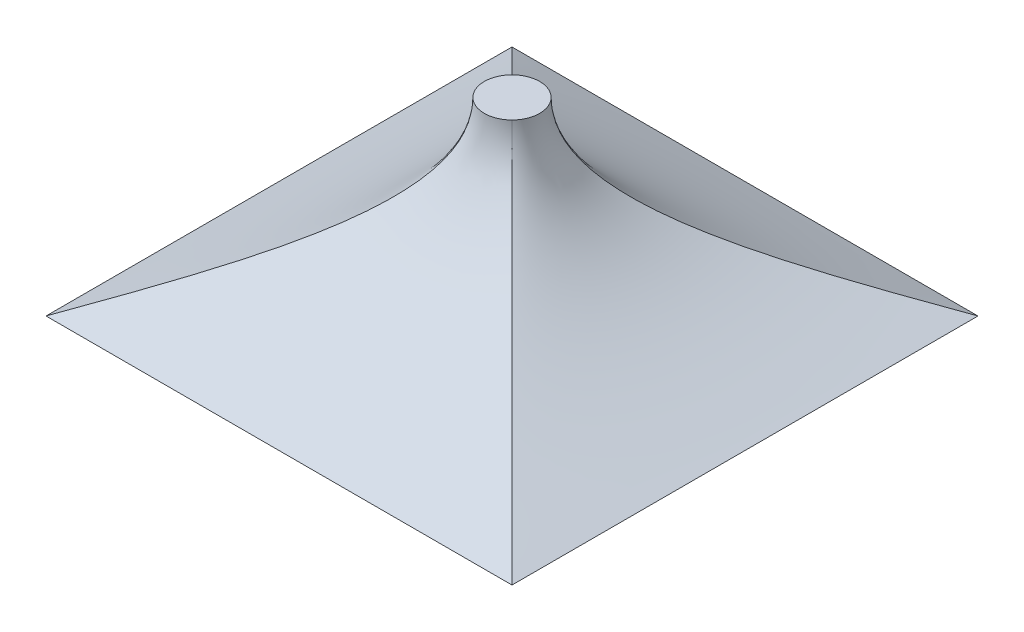
ISO-10303-21;
HEADER;
FILE_DESCRIPTION(('STEP AP214'),'2;1');
FILE_NAME('part.step','',(''),(''),'','','');
FILE_SCHEMA(('AUTOMOTIVE_DESIGN { 1 0 10303 214 1 1 1 1 }'));
ENDSEC;
DATA;
#1=APPLICATION_CONTEXT('core data for automotive mechanical design processes');
#2=APPLICATION_PROTOCOL_DEFINITION('international standard','automotive_design',2000,#1);
#3=PRODUCT_CONTEXT('',#1,'mechanical');
#4=PRODUCT('Part','Part','',(#3));
#5=PRODUCT_RELATED_PRODUCT_CATEGORY('part','',(#4));
#6=PRODUCT_DEFINITION_FORMATION('','',#4);
#7=PRODUCT_DEFINITION_CONTEXT('part definition',#1,'design');
#8=PRODUCT_DEFINITION('design','',#6,#7);
#9=PRODUCT_DEFINITION_SHAPE('','',#8);
#10=(LENGTH_UNIT() NAMED_UNIT(*) SI_UNIT(.MILLI.,.METRE.));
#11=(NAMED_UNIT(*) PLANE_ANGLE_UNIT() SI_UNIT($,.RADIAN.));
#12=(NAMED_UNIT(*) SI_UNIT($,.STERADIAN.) SOLID_ANGLE_UNIT());
#13=UNCERTAINTY_MEASURE_WITH_UNIT(LENGTH_MEASURE(1.E-05),#10,'distance_accuracy_value','');
#14=(GEOMETRIC_REPRESENTATION_CONTEXT(3) GLOBAL_UNCERTAINTY_ASSIGNED_CONTEXT((#13)) GLOBAL_UNIT_ASSIGNED_CONTEXT((#10,
#11,#12)) REPRESENTATION_CONTEXT('',''));
#15=CARTESIAN_POINT('',(0.,0.,0.));
#16=DIRECTION('',(0.,0.,1.));
#17=DIRECTION('',(1.,0.,0.));
#18=AXIS2_PLACEMENT_3D('',#15,#16,#17);
#19=CARTESIAN_POINT('',(0.,3.25,0.));
#20=DIRECTION('',(0.,1.,0.));
#21=DIRECTION('',(0.,0.,1.));
#22=AXIS2_PLACEMENT_3D('',#19,#20,#21);
#23=PLANE('',#22);
#24=CARTESIAN_POINT('',(0.,3.25,0.));
#25=DIRECTION('',(0.,1.,0.));
#26=DIRECTION('',(0.,0.,1.));
#27=AXIS2_PLACEMENT_3D('',#24,#25,#26);
#28=CIRCLE('',#27,0.475);
#29=CARTESIAN_POINT('',(0.33587572106361,3.25,0.335875721063609));
#30=VERTEX_POINT('',#29);
#31=CARTESIAN_POINT('',(0.33587572106361,3.25,-0.335875721063609));
#32=VERTEX_POINT('',#31);
#33=EDGE_CURVE('E121',#30,#32,#28,.T.);
#34=ORIENTED_EDGE('',*,*,#33,.T.);
#35=CARTESIAN_POINT('',(-0.33587572106361,3.25,-0.335875721063609));
#36=VERTEX_POINT('',#35);
#37=EDGE_CURVE('E116',#32,#36,#28,.T.);
#38=ORIENTED_EDGE('',*,*,#37,.T.);
#39=CARTESIAN_POINT('',(-0.33587572106361,3.25,0.335875721063609));
#40=VERTEX_POINT('',#39);
#41=EDGE_CURVE('E139',#36,#40,#28,.T.);
#42=ORIENTED_EDGE('',*,*,#41,.T.);
#43=EDGE_CURVE('E124',#40,#30,#28,.T.);
#44=ORIENTED_EDGE('',*,*,#43,.T.);
#45=EDGE_LOOP('',(#34,#38,#42,#44));
#46=FACE_BOUND('',#45,.T.);
#47=ADVANCED_FACE('F76',(#46),#23,.T.);
#48=CARTESIAN_POINT('',(0.,0.,0.));
#49=DIRECTION('',(0.,1.,0.));
#50=DIRECTION('',(0.,0.,1.));
#51=AXIS2_PLACEMENT_3D('',#48,#49,#50);
#52=PLANE('',#51);
#53=DIRECTION('',(0.,0.,-1.));
#54=VECTOR('',#53,1.);
#55=CARTESIAN_POINT('',(4.,0.,-4.));
#56=LINE('',#55,#54);
#57=CARTESIAN_POINT('',(4.00000000000001,0.,4.));
#58=VERTEX_POINT('',#57);
#59=CARTESIAN_POINT('',(4.,0.,-4.));
#60=VERTEX_POINT('',#59);
#61=EDGE_CURVE('E144',#58,#60,#56,.T.);
#62=ORIENTED_EDGE('',*,*,#61,.F.);
#63=DIRECTION('',(1.,0.,0.));
#64=VECTOR('',#63,1.);
#65=CARTESIAN_POINT('',(-4.,0.,4.));
#66=LINE('',#65,#64);
#67=CARTESIAN_POINT('',(-4.,0.,4.));
#68=VERTEX_POINT('',#67);
#69=EDGE_CURVE('E278',#68,#58,#66,.T.);
#70=ORIENTED_EDGE('',*,*,#69,.F.);
#71=DIRECTION('',(0.,0.,1.));
#72=VECTOR('',#71,1.);
#73=CARTESIAN_POINT('',(-4.,0.,-4.));
#74=LINE('',#73,#72);
#75=CARTESIAN_POINT('',(-4.,0.,-4.));
#76=VERTEX_POINT('',#75);
#77=EDGE_CURVE('E87',#76,#68,#74,.T.);
#78=ORIENTED_EDGE('',*,*,#77,.F.);
#79=DIRECTION('',(-1.,0.,0.));
#80=VECTOR('',#79,1.);
#81=CARTESIAN_POINT('',(-4.,0.,-4.));
#82=LINE('',#81,#80);
#83=EDGE_CURVE('E12',#60,#76,#82,.T.);
#84=ORIENTED_EDGE('',*,*,#83,.F.);
#85=EDGE_LOOP('',(#62,#70,#78,#84));
#86=FACE_BOUND('',#85,.T.);
#87=ADVANCED_FACE('F253',(#86),#52,.F.);
#88=CARTESIAN_POINT('',(-4.,0.,4.));
#89=CARTESIAN_POINT('',(-2.1679378605318,0.86041153366069,2.16793786053181));
#90=CARTESIAN_POINT('',(-0.33587572106361,1.72082306732138,0.335875721063609));
#91=CARTESIAN_POINT('',(-0.33587572106361,3.25,0.335875721063609));
#92=CARTESIAN_POINT('',(-1.33333333333333,0.,4.));
#93=CARTESIAN_POINT('',(-0.741917101236594,0.86041153366069,2.26062528649368));
#94=CARTESIAN_POINT('',(-0.150500869139859,1.72082306732138,0.521250572987362));
#95=CARTESIAN_POINT('',(-0.150500869139859,3.25,0.521250572987362));
#96=CARTESIAN_POINT('',(1.33333333333334,0.,4.));
#97=CARTESIAN_POINT('',(0.741917101236599,0.86041153366069,2.26062528649368));
#98=CARTESIAN_POINT('',(0.150500869139859,1.72082306732138,0.521250572987362));
#99=CARTESIAN_POINT('',(0.150500869139859,3.25,0.521250572987362));
#100=CARTESIAN_POINT('',(4.00000000000001,0.,4.));
#101=CARTESIAN_POINT('',(2.16793786053181,0.86041153366069,2.16793786053181));
#102=CARTESIAN_POINT('',(0.33587572106361,1.72082306732138,0.335875721063609));
#103=CARTESIAN_POINT('',(0.33587572106361,3.25,0.335875721063609));
#104=B_SPLINE_SURFACE_WITH_KNOTS('',3,3,((#88,#89,#90,#91),(#92,#93,#94,#95),(#96,#97,#98,#99),
(#100,#101,#102,#103)),.UNSPECIFIED.,.F.,.F.,.F.,(4,4),(4,4),(0.,1.),(0.,1.),.UNSPECIFIED.);
#105=CARTESIAN_POINT('',(4.00000000000001,0.,4.));
#106=CARTESIAN_POINT('',(2.16793786053181,0.86041153366069,2.16793786053181));
#107=CARTESIAN_POINT('',(0.33587572106361,1.72082306732138,0.335875721063609));
#108=CARTESIAN_POINT('',(0.33587572106361,3.25,0.335875721063609));
#109=B_SPLINE_CURVE_WITH_KNOTS('',3,(#105,#106,#107,#108),.UNSPECIFIED.,.F.,.F.,(4,4),(0.,1.),.UNSPECIFIED.);
#110=EDGE_CURVE('E149',#58,#30,#109,.T.);
#111=CARTESIAN_POINT('',(-4.,0.,4.));
#112=CARTESIAN_POINT('',(-2.1679378605318,0.86041153366069,2.16793786053181));
#113=CARTESIAN_POINT('',(-0.33587572106361,1.72082306732138,0.335875721063609));
#114=CARTESIAN_POINT('',(-0.33587572106361,3.25,0.335875721063609));
#115=B_SPLINE_CURVE_WITH_KNOTS('',3,(#111,#112,#113,#114),.UNSPECIFIED.,.F.,.F.,(4,4),(0.,1.),.UNSPECIFIED.);
#116=EDGE_CURVE('E146',#40,#68,#115,.F.);
#117=ORIENTED_EDGE('',*,*,#69,.T.);
#118=ORIENTED_EDGE('',*,*,#110,.T.);
#119=ORIENTED_EDGE('',*,*,#43,.F.);
#120=ORIENTED_EDGE('',*,*,#116,.T.);
#121=EDGE_LOOP('',(#117,#118,#119,#120));
#122=FACE_BOUND('',#121,.T.);
#123=ADVANCED_FACE('F236',(#122),#104,.T.);
#124=CARTESIAN_POINT('',(4.00000000000001,0.,4.));
#125=CARTESIAN_POINT('',(2.16793786053181,0.86041153366069,2.16793786053181));
#126=CARTESIAN_POINT('',(0.33587572106361,1.72082306732138,0.335875721063609));
#127=CARTESIAN_POINT('',(0.33587572106361,3.25,0.335875721063609));
#128=CARTESIAN_POINT('',(4.00000000000001,0.,1.33333333333333));
#129=CARTESIAN_POINT('',(2.26062528649368,0.86041153366069,0.741917101236595));
#130=CARTESIAN_POINT('',(0.521250572987361,1.72082306732138,0.150500869139859));
#131=CARTESIAN_POINT('',(0.521250572987361,3.25,0.150500869139859));
#132=CARTESIAN_POINT('',(4.,0.,-1.33333333333333));
#133=CARTESIAN_POINT('',(2.26062528649368,0.86041153366069,-0.741917101236595));
#134=CARTESIAN_POINT('',(0.521250572987361,1.72082306732138,-0.150500869139859));
#135=CARTESIAN_POINT('',(0.521250572987361,3.25,-0.150500869139859));
#136=CARTESIAN_POINT('',(4.,0.,-4.));
#137=CARTESIAN_POINT('',(2.16793786053181,0.86041153366069,-2.16793786053181));
#138=CARTESIAN_POINT('',(0.33587572106361,1.72082306732138,-0.335875721063609));
#139=CARTESIAN_POINT('',(0.33587572106361,3.25,-0.335875721063609));
#140=B_SPLINE_SURFACE_WITH_KNOTS('',3,3,((#124,#125,#126,#127),(#128,#129,#130,#131),(#132,#133,
#134,#135),(#136,#137,#138,#139)),.UNSPECIFIED.,.F.,.F.,.F.,(4,4),(4,4),(0.,1.),(0.,1.),.UNSPECIFIED.);
#141=CARTESIAN_POINT('',(4.,0.,-4.));
#142=CARTESIAN_POINT('',(2.16793786053181,0.86041153366069,-2.16793786053181));
#143=CARTESIAN_POINT('',(0.33587572106361,1.72082306732138,-0.335875721063609));
#144=CARTESIAN_POINT('',(0.33587572106361,3.25,-0.335875721063609));
#145=B_SPLINE_CURVE_WITH_KNOTS('',3,(#141,#142,#143,#144),.UNSPECIFIED.,.F.,.F.,(4,4),(0.,1.),.UNSPECIFIED.);
#146=EDGE_CURVE('E138',#60,#32,#145,.T.);
#147=ORIENTED_EDGE('',*,*,#61,.T.);
#148=ORIENTED_EDGE('',*,*,#146,.T.);
#149=ORIENTED_EDGE('',*,*,#33,.F.);
#150=ORIENTED_EDGE('',*,*,#110,.F.);
#151=EDGE_LOOP('',(#147,#148,#149,#150));
#152=FACE_BOUND('',#151,.T.);
#153=ADVANCED_FACE('F143',(#152),#140,.T.);
#154=CARTESIAN_POINT('',(-4.,0.,-4.));
#155=CARTESIAN_POINT('',(-2.1679378605318,0.86041153366069,-2.16793786053181));
#156=CARTESIAN_POINT('',(-0.33587572106361,1.72082306732138,-0.335875721063609));
#157=CARTESIAN_POINT('',(-0.33587572106361,3.25,-0.335875721063609));
#158=CARTESIAN_POINT('',(-4.,0.,-1.33333333333333));
#159=CARTESIAN_POINT('',(-2.26062528649368,0.86041153366069,-0.741917101236597));
#160=CARTESIAN_POINT('',(-0.521250572987361,1.72082306732138,-0.150500869139859));
#161=CARTESIAN_POINT('',(-0.521250572987361,3.25,-0.150500869139859));
#162=CARTESIAN_POINT('',(-4.,0.,1.33333333333333));
#163=CARTESIAN_POINT('',(-2.26062528649368,0.86041153366069,0.741917101236595));
#164=CARTESIAN_POINT('',(-0.521250572987361,1.72082306732138,0.150500869139859));
#165=CARTESIAN_POINT('',(-0.521250572987361,3.25,0.150500869139859));
#166=CARTESIAN_POINT('',(-4.,0.,4.));
#167=CARTESIAN_POINT('',(-2.1679378605318,0.86041153366069,2.16793786053181));
#168=CARTESIAN_POINT('',(-0.33587572106361,1.72082306732138,0.335875721063609));
#169=CARTESIAN_POINT('',(-0.33587572106361,3.25,0.335875721063609));
#170=B_SPLINE_SURFACE_WITH_KNOTS('',3,3,((#154,#155,#156,#157),(#158,#159,#160,#161),(#162,#163,
#164,#165),(#166,#167,#168,#169)),.UNSPECIFIED.,.F.,.F.,.F.,(4,4),(4,4),(0.,1.),(0.,1.),.UNSPECIFIED.);
#171=CARTESIAN_POINT('',(-4.,0.,-4.));
#172=CARTESIAN_POINT('',(-2.1679378605318,0.86041153366069,-2.16793786053181));
#173=CARTESIAN_POINT('',(-0.33587572106361,1.72082306732138,-0.335875721063609));
#174=CARTESIAN_POINT('',(-0.33587572106361,3.25,-0.335875721063609));
#175=B_SPLINE_CURVE_WITH_KNOTS('',3,(#171,#172,#173,#174),.UNSPECIFIED.,.F.,.F.,(4,4),(0.,1.),.UNSPECIFIED.);
#176=EDGE_CURVE('E129',#76,#36,#175,.T.);
#177=ORIENTED_EDGE('',*,*,#77,.T.);
#178=ORIENTED_EDGE('',*,*,#116,.F.);
#179=ORIENTED_EDGE('',*,*,#41,.F.);
#180=ORIENTED_EDGE('',*,*,#176,.F.);
#181=EDGE_LOOP('',(#177,#178,#179,#180));
#182=FACE_BOUND('',#181,.T.);
#183=ADVANCED_FACE('F178',(#182),#170,.T.);
#184=CARTESIAN_POINT('',(4.,0.,-4.));
#185=CARTESIAN_POINT('',(2.16793786053181,0.86041153366069,-2.16793786053181));
#186=CARTESIAN_POINT('',(0.33587572106361,1.72082306732138,-0.335875721063609));
#187=CARTESIAN_POINT('',(0.33587572106361,3.25,-0.335875721063609));
#188=CARTESIAN_POINT('',(1.33333333333334,0.,-4.));
#189=CARTESIAN_POINT('',(0.741917101236598,0.86041153366069,-2.26062528649368));
#190=CARTESIAN_POINT('',(0.150500869139859,1.72082306732138,-0.521250572987362));
#191=CARTESIAN_POINT('',(0.150500869139859,3.25,-0.521250572987362));
#192=CARTESIAN_POINT('',(-1.33333333333333,0.,-4.));
#193=CARTESIAN_POINT('',(-0.741917101236595,0.86041153366069,-2.26062528649368));
#194=CARTESIAN_POINT('',(-0.150500869139859,1.72082306732138,-0.521250572987362));
#195=CARTESIAN_POINT('',(-0.150500869139859,3.25,-0.521250572987362));
#196=CARTESIAN_POINT('',(-4.,0.,-4.));
#197=CARTESIAN_POINT('',(-2.1679378605318,0.86041153366069,-2.16793786053181));
#198=CARTESIAN_POINT('',(-0.33587572106361,1.72082306732138,-0.335875721063609));
#199=CARTESIAN_POINT('',(-0.33587572106361,3.25,-0.335875721063609));
#200=B_SPLINE_SURFACE_WITH_KNOTS('',3,3,((#184,#185,#186,#187),(#188,#189,#190,#191),(#192,#193,
#194,#195),(#196,#197,#198,#199)),.UNSPECIFIED.,.F.,.F.,.F.,(4,4),(4,4),(0.,1.),(0.,1.),.UNSPECIFIED.);
#201=ORIENTED_EDGE('',*,*,#83,.T.);
#202=ORIENTED_EDGE('',*,*,#176,.T.);
#203=ORIENTED_EDGE('',*,*,#37,.F.);
#204=ORIENTED_EDGE('',*,*,#146,.F.);
#205=EDGE_LOOP('',(#201,#202,#203,#204));
#206=FACE_BOUND('',#205,.T.);
#207=ADVANCED_FACE('F137',(#206),#200,.T.);
#208=CLOSED_SHELL('',(#47,#87,#123,#153,#183,#207));
#209=MANIFOLD_SOLID_BREP('B2',#208);
#210=ADVANCED_BREP_SHAPE_REPRESENTATION('',(#18,#209),#14);
#211=SHAPE_DEFINITION_REPRESENTATION(#9,#210);
ENDSEC;
END-ISO-10303-21;
